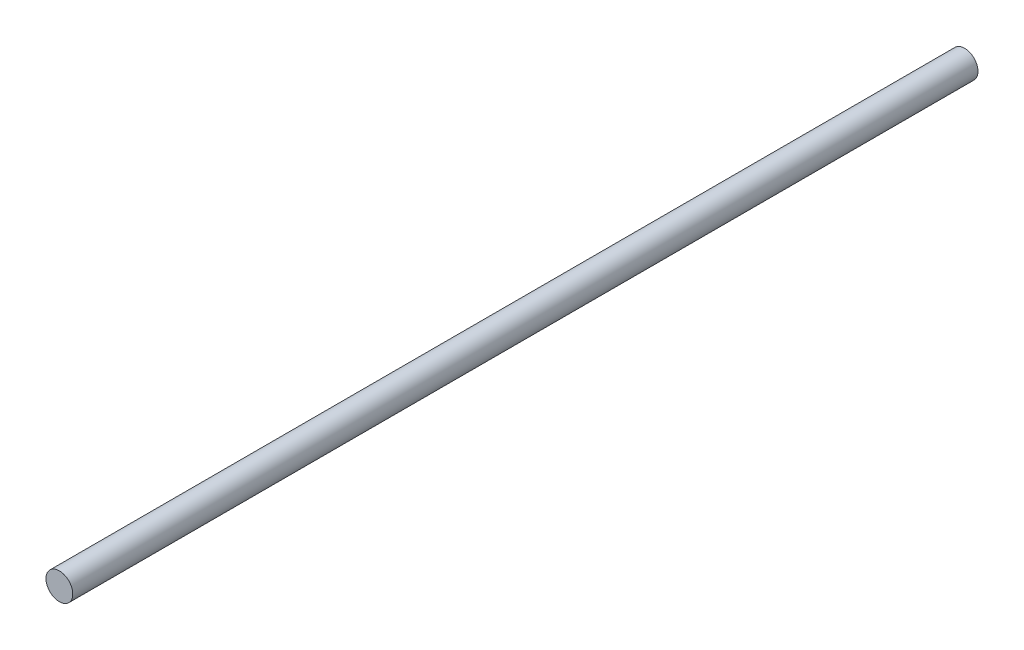
ISO-10303-21;
HEADER;
FILE_DESCRIPTION(('STEP AP214'),'2;1');
FILE_NAME('part.step','',(''),(''),'','','');
FILE_SCHEMA(('AUTOMOTIVE_DESIGN { 1 0 10303 214 1 1 1 1 }'));
ENDSEC;
DATA;
#1=APPLICATION_CONTEXT('core data for automotive mechanical design processes');
#2=APPLICATION_PROTOCOL_DEFINITION('international standard','automotive_design',2000,#1);
#3=PRODUCT_CONTEXT('',#1,'mechanical');
#4=PRODUCT('Part','Part','',(#3));
#5=PRODUCT_RELATED_PRODUCT_CATEGORY('part','',(#4));
#6=PRODUCT_DEFINITION_FORMATION('','',#4);
#7=PRODUCT_DEFINITION_CONTEXT('part definition',#1,'design');
#8=PRODUCT_DEFINITION('design','',#6,#7);
#9=PRODUCT_DEFINITION_SHAPE('','',#8);
#10=(LENGTH_UNIT() NAMED_UNIT(*) SI_UNIT(.MILLI.,.METRE.));
#11=(NAMED_UNIT(*) PLANE_ANGLE_UNIT() SI_UNIT($,.RADIAN.));
#12=(NAMED_UNIT(*) SI_UNIT($,.STERADIAN.) SOLID_ANGLE_UNIT());
#13=UNCERTAINTY_MEASURE_WITH_UNIT(LENGTH_MEASURE(1.E-05),#10,'distance_accuracy_value','');
#14=(GEOMETRIC_REPRESENTATION_CONTEXT(3) GLOBAL_UNCERTAINTY_ASSIGNED_CONTEXT((#13)) GLOBAL_UNIT_ASSIGNED_CONTEXT((#10,
#11,#12)) REPRESENTATION_CONTEXT('',''));
#15=CARTESIAN_POINT('',(0.,0.,0.));
#16=DIRECTION('',(0.,0.,1.));
#17=DIRECTION('',(1.,0.,0.));
#18=AXIS2_PLACEMENT_3D('',#15,#16,#17);
#19=CARTESIAN_POINT('',(0.,0.,338.));
#20=DIRECTION('',(0.,0.,-1.));
#21=DIRECTION('',(-1.,0.,0.));
#22=AXIS2_PLACEMENT_3D('',#19,#20,#21);
#23=CYLINDRICAL_SURFACE('',#22,10.);
#24=CARTESIAN_POINT('',(0.,0.,338.));
#25=DIRECTION('',(0.,0.,1.));
#26=DIRECTION('',(1.,0.,0.));
#27=AXIS2_PLACEMENT_3D('',#24,#25,#26);
#28=CIRCLE('',#27,10.);
#29=CARTESIAN_POINT('',(10.,0.,338.));
#30=VERTEX_POINT('',#29);
#31=EDGE_CURVE('E10',#30,#30,#28,.T.);
#32=ORIENTED_EDGE('',*,*,#31,.F.);
#33=EDGE_LOOP('',(#32));
#34=FACE_BOUND('',#33,.T.);
#35=CARTESIAN_POINT('',(0.,0.,-338.));
#36=DIRECTION('',(0.,0.,1.));
#37=DIRECTION('',(1.,0.,0.));
#38=AXIS2_PLACEMENT_3D('',#35,#36,#37);
#39=CIRCLE('',#38,10.);
#40=CARTESIAN_POINT('',(10.,0.,-338.));
#41=VERTEX_POINT('',#40);
#42=EDGE_CURVE('E34',#41,#41,#39,.T.);
#43=ORIENTED_EDGE('',*,*,#42,.T.);
#44=EDGE_LOOP('',(#43));
#45=FACE_BOUND('',#44,.T.);
#46=ADVANCED_FACE('F31',(#34,#45),#23,.T.);
#47=CARTESIAN_POINT('',(0.,0.,338.));
#48=DIRECTION('',(0.,0.,1.));
#49=DIRECTION('',(1.,0.,0.));
#50=AXIS2_PLACEMENT_3D('',#47,#48,#49);
#51=PLANE('',#50);
#52=ORIENTED_EDGE('',*,*,#31,.T.);
#53=EDGE_LOOP('',(#52));
#54=FACE_BOUND('',#53,.T.);
#55=ADVANCED_FACE('F46',(#54),#51,.T.);
#56=CARTESIAN_POINT('',(0.,0.,-338.));
#57=DIRECTION('',(0.,0.,1.));
#58=DIRECTION('',(1.,0.,0.));
#59=AXIS2_PLACEMENT_3D('',#56,#57,#58);
#60=PLANE('',#59);
#61=ORIENTED_EDGE('',*,*,#42,.F.);
#62=EDGE_LOOP('',(#61));
#63=FACE_BOUND('',#62,.T.);
#64=ADVANCED_FACE('F44',(#63),#60,.F.);
#65=CLOSED_SHELL('',(#46,#55,#64));
#66=MANIFOLD_SOLID_BREP('B2',#65);
#67=ADVANCED_BREP_SHAPE_REPRESENTATION('',(#18,#66),#14);
#68=SHAPE_DEFINITION_REPRESENTATION(#9,#67);
ENDSEC;
END-ISO-10303-21;
